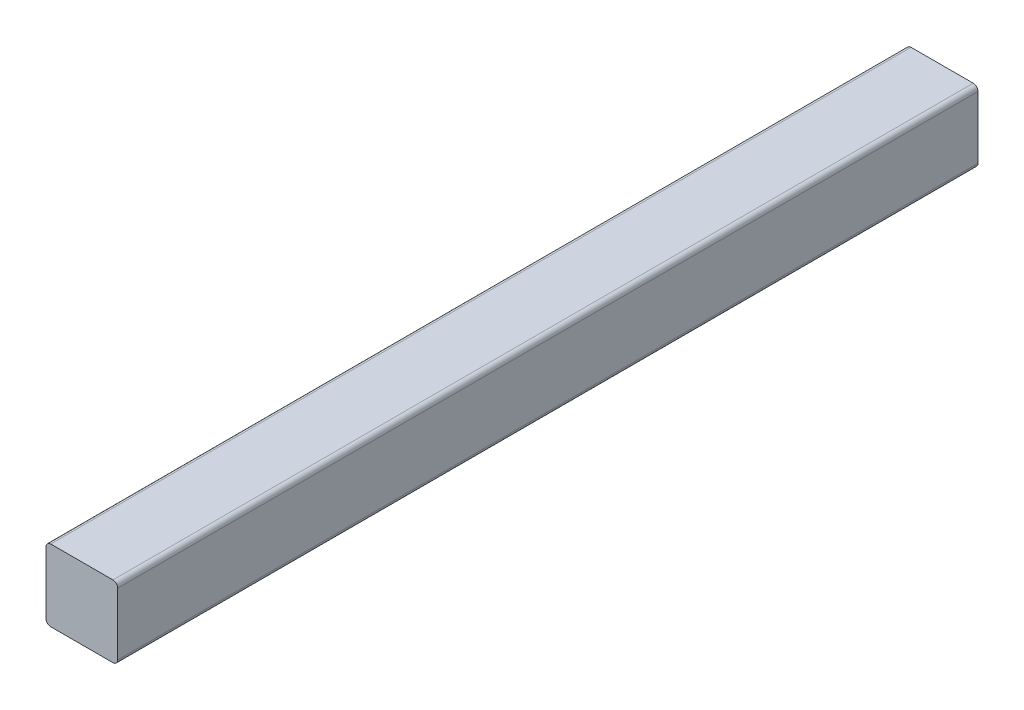
ISO-10303-21;
HEADER;
FILE_DESCRIPTION(('STEP AP214'),'2;1');
FILE_NAME('part.step','',(''),(''),'','','');
FILE_SCHEMA(('AUTOMOTIVE_DESIGN { 1 0 10303 214 1 1 1 1 }'));
ENDSEC;
DATA;
#1=APPLICATION_CONTEXT('core data for automotive mechanical design processes');
#2=APPLICATION_PROTOCOL_DEFINITION('international standard','automotive_design',2000,#1);
#3=PRODUCT_CONTEXT('',#1,'mechanical');
#4=PRODUCT('Part','Part','',(#3));
#5=PRODUCT_RELATED_PRODUCT_CATEGORY('part','',(#4));
#6=PRODUCT_DEFINITION_FORMATION('','',#4);
#7=PRODUCT_DEFINITION_CONTEXT('part definition',#1,'design');
#8=PRODUCT_DEFINITION('design','',#6,#7);
#9=PRODUCT_DEFINITION_SHAPE('','',#8);
#10=(LENGTH_UNIT() NAMED_UNIT(*) SI_UNIT(.MILLI.,.METRE.));
#11=(NAMED_UNIT(*) PLANE_ANGLE_UNIT() SI_UNIT($,.RADIAN.));
#12=(NAMED_UNIT(*) SI_UNIT($,.STERADIAN.) SOLID_ANGLE_UNIT());
#13=UNCERTAINTY_MEASURE_WITH_UNIT(LENGTH_MEASURE(1.E-05),#10,'distance_accuracy_value','');
#14=(GEOMETRIC_REPRESENTATION_CONTEXT(3) GLOBAL_UNCERTAINTY_ASSIGNED_CONTEXT((#13)) GLOBAL_UNIT_ASSIGNED_CONTEXT((#10,
#11,#12)) REPRESENTATION_CONTEXT('',''));
#15=CARTESIAN_POINT('',(0.,0.,0.));
#16=DIRECTION('',(0.,0.,1.));
#17=DIRECTION('',(1.,0.,0.));
#18=AXIS2_PLACEMENT_3D('',#15,#16,#17);
#19=CARTESIAN_POINT('',(2.,2.,360.));
#20=DIRECTION('',(0.,0.,-1.));
#21=DIRECTION('',(-1.,0.,0.));
#22=AXIS2_PLACEMENT_3D('',#19,#20,#21);
#23=CYLINDRICAL_SURFACE('',#22,2.);
#24=CARTESIAN_POINT('',(2.,2.,0.));
#25=DIRECTION('',(0.,0.,1.));
#26=DIRECTION('',(-1.,0.,0.));
#27=AXIS2_PLACEMENT_3D('',#24,#25,#26);
#28=CIRCLE('',#27,2.);
#29=CARTESIAN_POINT('',(0.,2.00000000000001,0.));
#30=VERTEX_POINT('',#29);
#31=CARTESIAN_POINT('',(2.00000000000001,0.,0.));
#32=VERTEX_POINT('',#31);
#33=EDGE_CURVE('E129',#30,#32,#28,.T.);
#34=ORIENTED_EDGE('',*,*,#33,.T.);
#35=DIRECTION('',(0.,0.,-1.));
#36=VECTOR('',#35,1.);
#37=CARTESIAN_POINT('',(2.00000000000001,0.,360.));
#38=LINE('',#37,#36);
#39=CARTESIAN_POINT('',(2.00000000000001,0.,360.));
#40=VERTEX_POINT('',#39);
#41=EDGE_CURVE('E11',#40,#32,#38,.T.);
#42=ORIENTED_EDGE('',*,*,#41,.F.);
#43=CARTESIAN_POINT('',(2.,2.,360.));
#44=DIRECTION('',(0.,0.,1.));
#45=DIRECTION('',(-1.,0.,0.));
#46=AXIS2_PLACEMENT_3D('',#43,#44,#45);
#47=CIRCLE('',#46,2.);
#48=CARTESIAN_POINT('',(0.,2.00000000000001,360.));
#49=VERTEX_POINT('',#48);
#50=EDGE_CURVE('E143',#49,#40,#47,.T.);
#51=ORIENTED_EDGE('',*,*,#50,.F.);
#52=DIRECTION('',(0.,0.,-1.));
#53=VECTOR('',#52,1.);
#54=CARTESIAN_POINT('',(0.,2.00000000000001,360.));
#55=LINE('',#54,#53);
#56=EDGE_CURVE('E125',#49,#30,#55,.T.);
#57=ORIENTED_EDGE('',*,*,#56,.T.);
#58=EDGE_LOOP('',(#34,#42,#51,#57));
#59=FACE_BOUND('',#58,.T.);
#60=ADVANCED_FACE('F33',(#59),#23,.T.);
#61=CARTESIAN_POINT('',(2.00000000000001,0.,360.));
#62=DIRECTION('',(0.,1.,0.));
#63=DIRECTION('',(0.,0.,1.));
#64=AXIS2_PLACEMENT_3D('',#61,#62,#63);
#65=PLANE('',#64);
#66=DIRECTION('',(1.,0.,0.));
#67=VECTOR('',#66,1.);
#68=CARTESIAN_POINT('',(2.00000000000001,0.,0.));
#69=LINE('',#68,#67);
#70=CARTESIAN_POINT('',(28.,0.,0.));
#71=VERTEX_POINT('',#70);
#72=EDGE_CURVE('E132',#32,#71,#69,.T.);
#73=ORIENTED_EDGE('',*,*,#72,.T.);
#74=DIRECTION('',(0.,0.,-1.));
#75=VECTOR('',#74,1.);
#76=CARTESIAN_POINT('',(28.,0.,360.));
#77=LINE('',#76,#75);
#78=CARTESIAN_POINT('',(28.,0.,360.));
#79=VERTEX_POINT('',#78);
#80=EDGE_CURVE('E41',#79,#71,#77,.T.);
#81=ORIENTED_EDGE('',*,*,#80,.F.);
#82=DIRECTION('',(1.,0.,0.));
#83=VECTOR('',#82,1.);
#84=CARTESIAN_POINT('',(2.00000000000001,0.,360.));
#85=LINE('',#84,#83);
#86=EDGE_CURVE('E92',#40,#79,#85,.T.);
#87=ORIENTED_EDGE('',*,*,#86,.F.);
#88=ORIENTED_EDGE('',*,*,#41,.T.);
#89=EDGE_LOOP('',(#73,#81,#87,#88));
#90=FACE_BOUND('',#89,.T.);
#91=ADVANCED_FACE('F178',(#90),#65,.F.);
#92=CARTESIAN_POINT('',(28.,2.,360.));
#93=DIRECTION('',(0.,0.,-1.));
#94=DIRECTION('',(-1.,0.,0.));
#95=AXIS2_PLACEMENT_3D('',#92,#93,#94);
#96=CYLINDRICAL_SURFACE('',#95,2.);
#97=CARTESIAN_POINT('',(28.,2.,0.));
#98=DIRECTION('',(0.,0.,1.));
#99=DIRECTION('',(-1.,0.,0.));
#100=AXIS2_PLACEMENT_3D('',#97,#98,#99);
#101=CIRCLE('',#100,2.);
#102=CARTESIAN_POINT('',(30.,2.00000000000001,0.));
#103=VERTEX_POINT('',#102);
#104=EDGE_CURVE('E134',#71,#103,#101,.T.);
#105=ORIENTED_EDGE('',*,*,#104,.T.);
#106=DIRECTION('',(0.,0.,-1.));
#107=VECTOR('',#106,1.);
#108=CARTESIAN_POINT('',(30.,2.00000000000001,360.));
#109=LINE('',#108,#107);
#110=CARTESIAN_POINT('',(30.,2.00000000000001,360.));
#111=VERTEX_POINT('',#110);
#112=EDGE_CURVE('E150',#111,#103,#109,.T.);
#113=ORIENTED_EDGE('',*,*,#112,.F.);
#114=CARTESIAN_POINT('',(28.,2.,360.));
#115=DIRECTION('',(0.,0.,1.));
#116=DIRECTION('',(-1.,0.,0.));
#117=AXIS2_PLACEMENT_3D('',#114,#115,#116);
#118=CIRCLE('',#117,2.);
#119=EDGE_CURVE('E158',#79,#111,#118,.T.);
#120=ORIENTED_EDGE('',*,*,#119,.F.);
#121=ORIENTED_EDGE('',*,*,#80,.T.);
#122=EDGE_LOOP('',(#105,#113,#120,#121));
#123=FACE_BOUND('',#122,.T.);
#124=ADVANCED_FACE('F156',(#123),#96,.T.);
#125=CARTESIAN_POINT('',(30.,2.00000000000001,360.));
#126=DIRECTION('',(-1.,0.,0.));
#127=DIRECTION('',(0.,0.,1.));
#128=AXIS2_PLACEMENT_3D('',#125,#126,#127);
#129=PLANE('',#128);
#130=DIRECTION('',(0.,1.,0.));
#131=VECTOR('',#130,1.);
#132=CARTESIAN_POINT('',(30.,2.00000000000001,0.));
#133=LINE('',#132,#131);
#134=CARTESIAN_POINT('',(30.,28.,0.));
#135=VERTEX_POINT('',#134);
#136=EDGE_CURVE('E136',#103,#135,#133,.T.);
#137=ORIENTED_EDGE('',*,*,#136,.T.);
#138=DIRECTION('',(0.,0.,-1.));
#139=VECTOR('',#138,1.);
#140=CARTESIAN_POINT('',(30.,28.,360.));
#141=LINE('',#140,#139);
#142=CARTESIAN_POINT('',(30.,28.,360.));
#143=VERTEX_POINT('',#142);
#144=EDGE_CURVE('E147',#143,#135,#141,.T.);
#145=ORIENTED_EDGE('',*,*,#144,.F.);
#146=DIRECTION('',(0.,1.,0.));
#147=VECTOR('',#146,1.);
#148=CARTESIAN_POINT('',(30.,2.00000000000001,360.));
#149=LINE('',#148,#147);
#150=EDGE_CURVE('E170',#111,#143,#149,.T.);
#151=ORIENTED_EDGE('',*,*,#150,.F.);
#152=ORIENTED_EDGE('',*,*,#112,.T.);
#153=EDGE_LOOP('',(#137,#145,#151,#152));
#154=FACE_BOUND('',#153,.T.);
#155=ADVANCED_FACE('F166',(#154),#129,.F.);
#156=CARTESIAN_POINT('',(28.,28.,360.));
#157=DIRECTION('',(0.,0.,-1.));
#158=DIRECTION('',(-1.,0.,0.));
#159=AXIS2_PLACEMENT_3D('',#156,#157,#158);
#160=CYLINDRICAL_SURFACE('',#159,2.);
#161=CARTESIAN_POINT('',(28.,28.,0.));
#162=DIRECTION('',(0.,0.,1.));
#163=DIRECTION('',(-1.,0.,0.));
#164=AXIS2_PLACEMENT_3D('',#161,#162,#163);
#165=CIRCLE('',#164,2.);
#166=CARTESIAN_POINT('',(28.,30.,0.));
#167=VERTEX_POINT('',#166);
#168=EDGE_CURVE('E138',#135,#167,#165,.T.);
#169=ORIENTED_EDGE('',*,*,#168,.T.);
#170=DIRECTION('',(0.,0.,-1.));
#171=VECTOR('',#170,1.);
#172=CARTESIAN_POINT('',(28.,30.,360.));
#173=LINE('',#172,#171);
#174=CARTESIAN_POINT('',(28.,30.,360.));
#175=VERTEX_POINT('',#174);
#176=EDGE_CURVE('E120',#175,#167,#173,.T.);
#177=ORIENTED_EDGE('',*,*,#176,.F.);
#178=CARTESIAN_POINT('',(28.,28.,360.));
#179=DIRECTION('',(0.,0.,1.));
#180=DIRECTION('',(-1.,0.,0.));
#181=AXIS2_PLACEMENT_3D('',#178,#179,#180);
#182=CIRCLE('',#181,2.);
#183=EDGE_CURVE('E111',#143,#175,#182,.T.);
#184=ORIENTED_EDGE('',*,*,#183,.F.);
#185=ORIENTED_EDGE('',*,*,#144,.T.);
#186=EDGE_LOOP('',(#169,#177,#184,#185));
#187=FACE_BOUND('',#186,.T.);
#188=ADVANCED_FACE('F169',(#187),#160,.T.);
#189=CARTESIAN_POINT('',(28.,30.,360.));
#190=DIRECTION('',(0.,-1.,0.));
#191=DIRECTION('',(0.,0.,-1.));
#192=AXIS2_PLACEMENT_3D('',#189,#190,#191);
#193=PLANE('',#192);
#194=DIRECTION('',(-1.,0.,0.));
#195=VECTOR('',#194,1.);
#196=CARTESIAN_POINT('',(28.,30.,0.));
#197=LINE('',#196,#195);
#198=CARTESIAN_POINT('',(2.00000000000001,30.,0.));
#199=VERTEX_POINT('',#198);
#200=EDGE_CURVE('E119',#167,#199,#197,.T.);
#201=ORIENTED_EDGE('',*,*,#200,.T.);
#202=DIRECTION('',(0.,0.,-1.));
#203=VECTOR('',#202,1.);
#204=CARTESIAN_POINT('',(2.00000000000001,30.,360.));
#205=LINE('',#204,#203);
#206=CARTESIAN_POINT('',(2.00000000000001,30.,360.));
#207=VERTEX_POINT('',#206);
#208=EDGE_CURVE('E116',#207,#199,#205,.T.);
#209=ORIENTED_EDGE('',*,*,#208,.F.);
#210=DIRECTION('',(-1.,0.,0.));
#211=VECTOR('',#210,1.);
#212=CARTESIAN_POINT('',(28.,30.,360.));
#213=LINE('',#212,#211);
#214=EDGE_CURVE('E105',#175,#207,#213,.T.);
#215=ORIENTED_EDGE('',*,*,#214,.F.);
#216=ORIENTED_EDGE('',*,*,#176,.T.);
#217=EDGE_LOOP('',(#201,#209,#215,#216));
#218=FACE_BOUND('',#217,.T.);
#219=ADVANCED_FACE('F117',(#218),#193,.F.);
#220=CARTESIAN_POINT('',(2.,28.,360.));
#221=DIRECTION('',(0.,0.,-1.));
#222=DIRECTION('',(-1.,0.,0.));
#223=AXIS2_PLACEMENT_3D('',#220,#221,#222);
#224=CYLINDRICAL_SURFACE('',#223,2.);
#225=CARTESIAN_POINT('',(2.,28.,0.));
#226=DIRECTION('',(0.,0.,1.));
#227=DIRECTION('',(-1.,0.,0.));
#228=AXIS2_PLACEMENT_3D('',#225,#226,#227);
#229=CIRCLE('',#228,2.);
#230=CARTESIAN_POINT('',(0.,28.,0.));
#231=VERTEX_POINT('',#230);
#232=EDGE_CURVE('E78',#199,#231,#229,.T.);
#233=ORIENTED_EDGE('',*,*,#232,.T.);
#234=DIRECTION('',(0.,0.,-1.));
#235=VECTOR('',#234,1.);
#236=CARTESIAN_POINT('',(0.,28.,360.));
#237=LINE('',#236,#235);
#238=CARTESIAN_POINT('',(0.,28.,360.));
#239=VERTEX_POINT('',#238);
#240=EDGE_CURVE('E121',#239,#231,#237,.T.);
#241=ORIENTED_EDGE('',*,*,#240,.F.);
#242=CARTESIAN_POINT('',(2.,28.,360.));
#243=DIRECTION('',(0.,0.,1.));
#244=DIRECTION('',(-1.,0.,0.));
#245=AXIS2_PLACEMENT_3D('',#242,#243,#244);
#246=CIRCLE('',#245,2.);
#247=EDGE_CURVE('E109',#207,#239,#246,.T.);
#248=ORIENTED_EDGE('',*,*,#247,.F.);
#249=ORIENTED_EDGE('',*,*,#208,.T.);
#250=EDGE_LOOP('',(#233,#241,#248,#249));
#251=FACE_BOUND('',#250,.T.);
#252=ADVANCED_FACE('F123',(#251),#224,.T.);
#253=CARTESIAN_POINT('',(0.,28.,360.));
#254=DIRECTION('',(1.,0.,0.));
#255=DIRECTION('',(0.,0.,-1.));
#256=AXIS2_PLACEMENT_3D('',#253,#254,#255);
#257=PLANE('',#256);
#258=DIRECTION('',(0.,-1.,0.));
#259=VECTOR('',#258,1.);
#260=CARTESIAN_POINT('',(0.,28.,0.));
#261=LINE('',#260,#259);
#262=EDGE_CURVE('E84',#231,#30,#261,.T.);
#263=ORIENTED_EDGE('',*,*,#262,.T.);
#264=ORIENTED_EDGE('',*,*,#56,.F.);
#265=DIRECTION('',(0.,-1.,0.));
#266=VECTOR('',#265,1.);
#267=CARTESIAN_POINT('',(0.,28.,360.));
#268=LINE('',#267,#266);
#269=EDGE_CURVE('E49',#239,#49,#268,.T.);
#270=ORIENTED_EDGE('',*,*,#269,.F.);
#271=ORIENTED_EDGE('',*,*,#240,.T.);
#272=EDGE_LOOP('',(#263,#264,#270,#271));
#273=FACE_BOUND('',#272,.T.);
#274=ADVANCED_FACE('F194',(#273),#257,.F.);
#275=CARTESIAN_POINT('',(2.,2.,360.));
#276=DIRECTION('',(0.,0.,-1.));
#277=DIRECTION('',(-1.,0.,0.));
#278=AXIS2_PLACEMENT_3D('',#275,#276,#277);
#279=PLANE('',#278);
#280=ORIENTED_EDGE('',*,*,#50,.T.);
#281=ORIENTED_EDGE('',*,*,#86,.T.);
#282=ORIENTED_EDGE('',*,*,#119,.T.);
#283=ORIENTED_EDGE('',*,*,#150,.T.);
#284=ORIENTED_EDGE('',*,*,#183,.T.);
#285=ORIENTED_EDGE('',*,*,#214,.T.);
#286=ORIENTED_EDGE('',*,*,#247,.T.);
#287=ORIENTED_EDGE('',*,*,#269,.T.);
#288=EDGE_LOOP('',(#280,#281,#282,#283,#284,#285,#286,#287));
#289=FACE_BOUND('',#288,.T.);
#290=ADVANCED_FACE('F107',(#289),#279,.F.);
#291=CARTESIAN_POINT('',(2.,2.,0.));
#292=DIRECTION('',(0.,0.,-1.));
#293=DIRECTION('',(-1.,0.,0.));
#294=AXIS2_PLACEMENT_3D('',#291,#292,#293);
#295=PLANE('',#294);
#296=ORIENTED_EDGE('',*,*,#33,.F.);
#297=ORIENTED_EDGE('',*,*,#262,.F.);
#298=ORIENTED_EDGE('',*,*,#232,.F.);
#299=ORIENTED_EDGE('',*,*,#200,.F.);
#300=ORIENTED_EDGE('',*,*,#168,.F.);
#301=ORIENTED_EDGE('',*,*,#136,.F.);
#302=ORIENTED_EDGE('',*,*,#104,.F.);
#303=ORIENTED_EDGE('',*,*,#72,.F.);
#304=EDGE_LOOP('',(#296,#297,#298,#299,#300,#301,#302,#303));
#305=FACE_BOUND('',#304,.T.);
#306=ADVANCED_FACE('F162',(#305),#295,.T.);
#307=CLOSED_SHELL('',(#60,#91,#124,#155,#188,#219,#252,#274,#290,#306));
#308=MANIFOLD_SOLID_BREP('B2',#307);
#309=ADVANCED_BREP_SHAPE_REPRESENTATION('',(#18,#308),#14);
#310=SHAPE_DEFINITION_REPRESENTATION(#9,#309);
ENDSEC;
END-ISO-10303-21;
